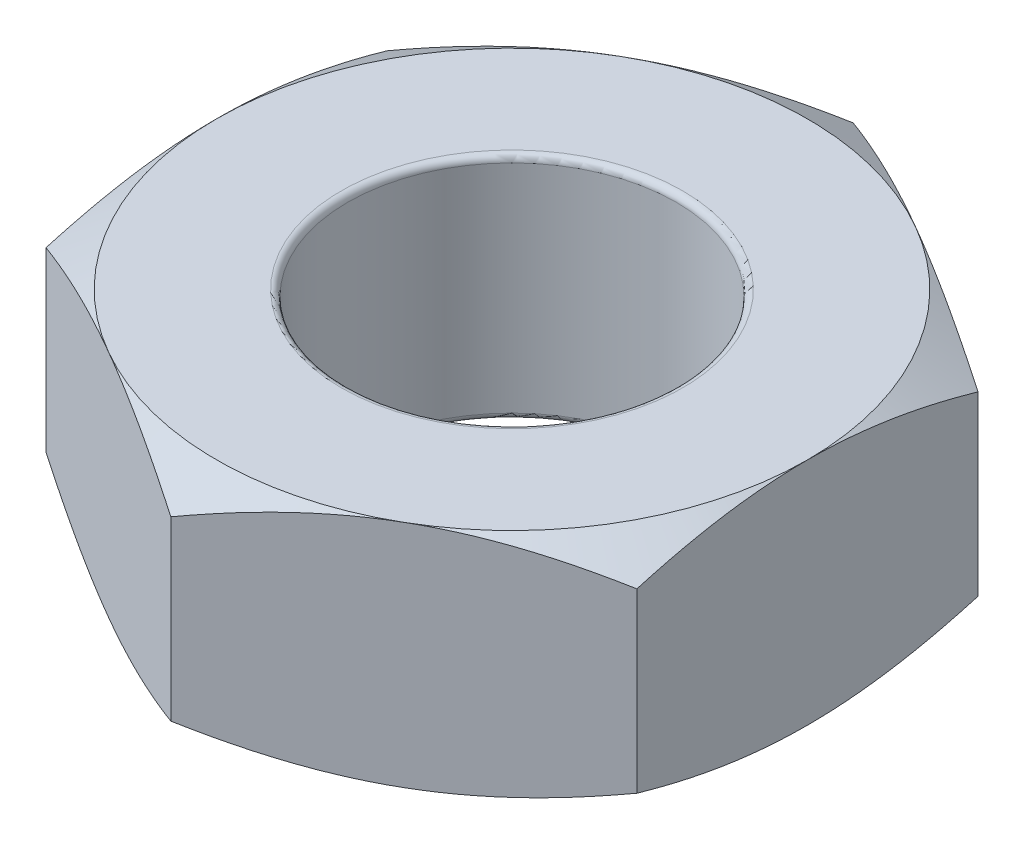
ISO-10303-21;
HEADER;
FILE_DESCRIPTION(('STEP AP214'),'2;1');
FILE_NAME('part.step','',(''),(''),'','','');
FILE_SCHEMA(('AUTOMOTIVE_DESIGN { 1 0 10303 214 1 1 1 1 }'));
ENDSEC;
DATA;
#1=APPLICATION_CONTEXT('core data for automotive mechanical design processes');
#2=APPLICATION_PROTOCOL_DEFINITION('international standard','automotive_design',2000,#1);
#3=PRODUCT_CONTEXT('',#1,'mechanical');
#4=PRODUCT('Part','Part','',(#3));
#5=PRODUCT_RELATED_PRODUCT_CATEGORY('part','',(#4));
#6=PRODUCT_DEFINITION_FORMATION('','',#4);
#7=PRODUCT_DEFINITION_CONTEXT('part definition',#1,'design');
#8=PRODUCT_DEFINITION('design','',#6,#7);
#9=PRODUCT_DEFINITION_SHAPE('','',#8);
#10=(LENGTH_UNIT() NAMED_UNIT(*) SI_UNIT(.MILLI.,.METRE.));
#11=(NAMED_UNIT(*) PLANE_ANGLE_UNIT() SI_UNIT($,.RADIAN.));
#12=(NAMED_UNIT(*) SI_UNIT($,.STERADIAN.) SOLID_ANGLE_UNIT());
#13=UNCERTAINTY_MEASURE_WITH_UNIT(LENGTH_MEASURE(1.E-05),#10,'distance_accuracy_value','');
#14=(GEOMETRIC_REPRESENTATION_CONTEXT(3) GLOBAL_UNCERTAINTY_ASSIGNED_CONTEXT((#13)) GLOBAL_UNIT_ASSIGNED_CONTEXT((#10,
#11,#12)) REPRESENTATION_CONTEXT('',''));
#15=CARTESIAN_POINT('',(0.,0.,0.));
#16=DIRECTION('',(0.,0.,1.));
#17=DIRECTION('',(1.,0.,0.));
#18=AXIS2_PLACEMENT_3D('',#15,#16,#17);
#19=CARTESIAN_POINT('',(0.,1.75,2.59807621135332));
#20=DIRECTION('',(-0.5,0.,-0.866025403784439));
#21=DIRECTION('',(-0.866025403784439,0.,0.5));
#22=AXIS2_PLACEMENT_3D('',#19,#20,#21);
#23=PLANE('',#22);
#24=CARTESIAN_POINT('',(2.2502,0.201028565434255,1.29892263562282));
#25=CARTESIAN_POINT('',(2.15132275118564,0.168055578047864,1.35600944184252));
#26=CARTESIAN_POINT('',(2.05159200282091,0.138067535415598,1.41358901625738));
#27=CARTESIAN_POINT('',(1.85040345977937,0.0857223882308783,1.52974527574029));
#28=CARTESIAN_POINT('',(1.74894208949705,0.0633838027064789,1.58832402518513));
#29=CARTESIAN_POINT('',(1.54727681019892,0.0286095576734192,1.7047555284741));
#30=CARTESIAN_POINT('',(1.44710393502333,0.0159424738337187,1.76259036492223));
#31=CARTESIAN_POINT('',(1.24628668739732,0.00081890741741938,1.87853225689703));
#32=CARTESIAN_POINT('',(1.1456430451668,-0.00165009697600096,1.93663889083104));
#33=CARTESIAN_POINT('',(0.957574835473434,0.00347837463602978,2.04522012232352));
#34=CARTESIAN_POINT('',(0.870122156108741,0.00981663451512071,2.09571095029608));
#35=CARTESIAN_POINT('',(0.695786567891225,0.0299076571898894,2.19636364908279));
#36=CARTESIAN_POINT('',(0.608904262311711,0.0436672872310841,2.24652517159694));
#37=CARTESIAN_POINT('',(0.434209045898264,0.0780662653506658,2.34738550181938));
#38=CARTESIAN_POINT('',(0.346418252564746,0.0988514715826557,2.39807153998286));
#39=CARTESIAN_POINT('',(0.172146263122405,0.146026087362979,2.49868751999961));
#40=CARTESIAN_POINT('',(0.0856628332489973,0.172404408014302,2.54861875151746));
#41=CARTESIAN_POINT('',(-0.000200000000000489,0.201028565434255,2.59819168140715));
#42=B_SPLINE_CURVE_WITH_KNOTS('',3,(#24,#25,#26,#27,#28,#29,#30,#31,#32,#33,#34,#35,#36,#37,#38,
#39,#40,#41),.UNSPECIFIED.,.F.,.F.,(4,2,2,2,2,2,2,2,4),(0.,0.356658826016552,0.714175103224236,
1.06284241804968,1.41108149062516,1.71433394539794,2.01786749258222,2.32813511279245,
2.63779325460359),.UNSPECIFIED.);
#43=CARTESIAN_POINT('',(2.25,0.200961894323341,1.29903810567666));
#44=VERTEX_POINT('',#43);
#45=CARTESIAN_POINT('',(1.125,0.,1.94855715851499));
#46=VERTEX_POINT('',#45);
#47=EDGE_CURVE('E126',#44,#46,#42,.T.);
#48=ORIENTED_EDGE('',*,*,#47,.F.);
#49=DIRECTION('',(0.,-1.,0.));
#50=VECTOR('',#49,1.);
#51=CARTESIAN_POINT('',(2.25,1.75,1.29903810567666));
#52=LINE('',#51,#50);
#53=CARTESIAN_POINT('',(2.25,1.54903810567666,1.29903810567666));
#54=VERTEX_POINT('',#53);
#55=EDGE_CURVE('E232',#54,#44,#52,.T.);
#56=ORIENTED_EDGE('',*,*,#55,.F.);
#57=CARTESIAN_POINT('',(-0.000200000000000392,1.54897143456575,2.59819168140715));
#58=CARTESIAN_POINT('',(0.0986772488143567,1.58194442195214,2.54110487518746));
#59=CARTESIAN_POINT('',(0.198407997179093,1.6119324645844,2.48352530077259));
#60=CARTESIAN_POINT('',(0.399596540220632,1.66427761176912,2.36736904128969));
#61=CARTESIAN_POINT('',(0.501057910502945,1.68661619729352,2.30879029184485));
#62=CARTESIAN_POINT('',(0.702723189801079,1.72139044232658,2.19235878855587));
#63=CARTESIAN_POINT('',(0.802896064976672,1.73405752616628,2.13452395210774));
#64=CARTESIAN_POINT('',(1.00371331260268,1.74918109258258,2.01858206013295));
#65=CARTESIAN_POINT('',(1.1043569548332,1.751650096976,1.96047542619893));
#66=CARTESIAN_POINT('',(1.29242516452657,1.74652162536397,1.85189419470646));
#67=CARTESIAN_POINT('',(1.37987784389126,1.74018336548488,1.8014033667339));
#68=CARTESIAN_POINT('',(1.55421343210877,1.72009234281011,1.70075066794718));
#69=CARTESIAN_POINT('',(1.64109573768829,1.70633271276892,1.65058914543304));
#70=CARTESIAN_POINT('',(1.81579095410174,1.67193373464933,1.54972881521059));
#71=CARTESIAN_POINT('',(1.90358174743525,1.65114852841734,1.49904277704712));
#72=CARTESIAN_POINT('',(2.0778537368776,1.60397391263702,1.39842679703037));
#73=CARTESIAN_POINT('',(2.164337166751,1.5775955919857,1.34849556551251));
#74=CARTESIAN_POINT('',(2.2502,1.54897143456575,1.29892263562282));
#75=B_SPLINE_CURVE_WITH_KNOTS('',3,(#57,#58,#59,#60,#61,#62,#63,#64,#65,#66,#67,#68,#69,#70,#71,
#72,#73,#74),.UNSPECIFIED.,.F.,.F.,(4,2,2,2,2,2,2,2,4),(0.,0.356658826016552,0.714175103224236,
1.06284241804968,1.41108149062516,1.71433394539794,2.01786749258222,2.32813511279245,
2.63779325460359),.UNSPECIFIED.);
#76=CARTESIAN_POINT('',(1.125,1.75,1.94855715851499));
#77=VERTEX_POINT('',#76);
#78=EDGE_CURVE('E373',#77,#54,#75,.T.);
#79=ORIENTED_EDGE('',*,*,#78,.F.);
#80=CARTESIAN_POINT('',(0.,1.54903810567666,2.59807621135332));
#81=VERTEX_POINT('',#80);
#82=EDGE_CURVE('E362',#81,#77,#75,.T.);
#83=ORIENTED_EDGE('',*,*,#82,.F.);
#84=DIRECTION('',(0.,-1.,0.));
#85=VECTOR('',#84,1.);
#86=CARTESIAN_POINT('',(0.,1.75,2.59807621135332));
#87=LINE('',#86,#85);
#88=CARTESIAN_POINT('',(0.,0.200961894323341,2.59807621135332));
#89=VERTEX_POINT('',#88);
#90=EDGE_CURVE('E161',#81,#89,#87,.T.);
#91=ORIENTED_EDGE('',*,*,#90,.T.);
#92=EDGE_CURVE('E139',#46,#89,#42,.T.);
#93=ORIENTED_EDGE('',*,*,#92,.F.);
#94=EDGE_LOOP('',(#48,#56,#79,#83,#91,#93));
#95=FACE_BOUND('',#94,.T.);
#96=ADVANCED_FACE('F37',(#95),#23,.F.);
#97=CARTESIAN_POINT('',(2.25,1.75,1.29903810567666));
#98=DIRECTION('',(-1.,0.,0.));
#99=DIRECTION('',(0.,0.,1.));
#100=AXIS2_PLACEMENT_3D('',#97,#98,#99);
#101=PLANE('',#100);
#102=CARTESIAN_POINT('',(2.25,1.57049861982334,-4.43172912721208));
#103=CARTESIAN_POINT('',(2.25,1.51735693759209,-4.32848794492226));
#104=CARTESIAN_POINT('',(2.25,1.46450484743296,-4.22509639331572));
#105=CARTESIAN_POINT('',(2.25,1.35952530789621,-4.01794384416323));
#106=CARTESIAN_POINT('',(2.25,1.30739787204856,-3.91418283976455));
#107=CARTESIAN_POINT('',(2.25,1.20393081844307,-3.70605700815303));
#108=CARTESIAN_POINT('',(2.25,1.1525926236047,-3.60169147231438));
#109=CARTESIAN_POINT('',(2.25,1.05099117669964,-3.39243582155597));
#110=CARTESIAN_POINT('',(2.25,1.000727939927,-3.28754569919877));
#111=CARTESIAN_POINT('',(2.25,0.898925995293035,-3.07160047020286));
#112=CARTESIAN_POINT('',(2.25,0.847459290612846,-2.96051132352861));
#113=CARTESIAN_POINT('',(2.25,0.746406212005017,-2.73748183196732));
#114=CARTESIAN_POINT('',(2.25,0.696819787356086,-2.62554151013899));
#115=CARTESIAN_POINT('',(2.25,0.600100967453589,-2.40069008962636));
#116=CARTESIAN_POINT('',(2.25,0.552966929054417,-2.28777970157739));
#117=CARTESIAN_POINT('',(2.25,0.46184651106863,-2.06065851247683));
#118=CARTESIAN_POINT('',(2.25,0.417860865336628,-1.94644741538902));
#119=CARTESIAN_POINT('',(2.25,0.32729368556671,-1.69797138865069));
#120=CARTESIAN_POINT('',(2.25,0.281435016134631,-1.56343919862733));
#121=CARTESIAN_POINT('',(2.25,0.1974750705298,-1.29200018214826));
#122=CARTESIAN_POINT('',(2.25,0.159369866726331,-1.15509459630545));
#123=CARTESIAN_POINT('',(2.25,0.0942889667848681,-0.881369269399072));
#124=CARTESIAN_POINT('',(2.25,0.0671140468085102,-0.744598126937423));
#125=CARTESIAN_POINT('',(2.25,0.0257222330991212,-0.469086445681223));
#126=CARTESIAN_POINT('',(2.25,0.0114977452462131,-0.330347109575203));
#127=CARTESIAN_POINT('',(2.25,0.00123269639131386,-0.120784370517545));
#128=CARTESIAN_POINT('',(2.25,-0.000315601094854518,-0.050203974634935));
#129=CARTESIAN_POINT('',(2.25,0.000422033997697021,0.0909367469657694));
#130=CARTESIAN_POINT('',(2.25,0.00270796730213804,0.161497072680062));
#131=CARTESIAN_POINT('',(2.25,0.0152377813490386,0.372864383623227));
#132=CARTESIAN_POINT('',(2.25,0.0311535146577739,0.51336108414487));
#133=CARTESIAN_POINT('',(2.25,0.0764279690031743,0.794982413158729));
#134=CARTESIAN_POINT('',(2.25,0.106052731323689,0.93606200731604));
#135=CARTESIAN_POINT('',(2.25,0.175669429631058,1.21561548141805));
#136=CARTESIAN_POINT('',(2.25,0.215664560549491,1.35408854420889));
#137=CARTESIAN_POINT('',(2.25,0.301433813240795,1.62298376559588));
#138=CARTESIAN_POINT('',(2.25,0.346906272940259,1.75350414338493));
#139=CARTESIAN_POINT('',(2.25,0.442941824020627,2.01267340913791));
#140=CARTESIAN_POINT('',(2.25,0.493506146306572,2.14132183593333));
#141=CARTESIAN_POINT('',(2.25,0.598415917250672,2.3972089614727));
#142=CARTESIAN_POINT('',(2.25,0.652765191067168,2.5244460788882));
#143=CARTESIAN_POINT('',(2.25,0.7642440388293,2.77769813848635));
#144=CARTESIAN_POINT('',(2.25,0.821373763792894,2.9037130138371));
#145=CARTESIAN_POINT('',(2.25,0.934436062749626,3.1476496239965));
#146=CARTESIAN_POINT('',(2.25,0.990252927298657,3.26562520727676));
#147=CARTESIAN_POINT('',(2.25,1.10334942732948,3.50087634814471));
#148=CARTESIAN_POINT('',(2.25,1.16062911044141,3.61815188278466));
#149=CARTESIAN_POINT('',(2.25,1.27615326827056,3.85174791850405));
#150=CARTESIAN_POINT('',(2.25,1.3343939714757,3.96807028911019));
#151=CARTESIAN_POINT('',(2.25,1.45180296105985,4.20023381118101));
#152=CARTESIAN_POINT('',(2.25,1.51097116762094,4.31607500298083));
#153=CARTESIAN_POINT('',(2.25,1.57049861982334,4.43172912721208));
#154=B_SPLINE_CURVE_WITH_KNOTS('',3,(#102,#103,#104,#105,#106,#107,#108,#109,#110,#111,#112,
#113,#114,#115,#116,#117,#118,#119,#120,#121,#122,#123,#124,#125,#126,#127,#128,#129,#130,#131,
#132,#133,#134,#135,#136,#137,#138,#139,#140,#141,#142,#143,#144,#145,#146,#147,#148,#149,#150,
#151,#152,#153),.UNSPECIFIED.,.F.,.F.,(4,2,2,2,2,2,2,2,2,2,2,2,2,2,2,2,2,2,2,2,2,2,2,2,2,4),(0.,
0.348347395383933,0.696701286027884,1.04562309484171,1.39454986466947,1.76183249981756,
2.12910522031386,2.49612860556298,2.86323726307789,3.2894710608127,3.71548840311864,
4.13334452619794,4.55095546076511,4.7626532574073,4.97435109411843,5.39773666667533,
5.82970728415092,6.26181114277157,6.67631854142574,7.09092638459783,7.50595949709434,
7.92101517699111,8.31254332110153,8.70408422986847,9.09434358465052,9.48456953737431),.UNSPECIFIED.);
#155=CARTESIAN_POINT('',(2.25,0.200961894323341,-1.29903810567666));
#156=VERTEX_POINT('',#155);
#157=CARTESIAN_POINT('',(2.25,0.,0.));
#158=VERTEX_POINT('',#157);
#159=EDGE_CURVE('E52',#156,#158,#154,.T.);
#160=ORIENTED_EDGE('',*,*,#159,.F.);
#161=DIRECTION('',(0.,-1.,0.));
#162=VECTOR('',#161,1.);
#163=CARTESIAN_POINT('',(2.25,1.75,-1.29903810567666));
#164=LINE('',#163,#162);
#165=CARTESIAN_POINT('',(2.25,1.54903810567666,-1.29903810567666));
#166=VERTEX_POINT('',#165);
#167=EDGE_CURVE('E365',#166,#156,#164,.T.);
#168=ORIENTED_EDGE('',*,*,#167,.F.);
#169=CARTESIAN_POINT('',(2.25,0.179501380176658,4.43172912721208));
#170=CARTESIAN_POINT('',(2.25,0.232643062407914,4.32848794492226));
#171=CARTESIAN_POINT('',(2.25,0.285495152567037,4.22509639331572));
#172=CARTESIAN_POINT('',(2.25,0.390474692103786,4.01794384416323));
#173=CARTESIAN_POINT('',(2.25,0.442602127951438,3.91418283976455));
#174=CARTESIAN_POINT('',(2.25,0.546069181556927,3.70605700815303));
#175=CARTESIAN_POINT('',(2.25,0.597407376395302,3.60169147231438));
#176=CARTESIAN_POINT('',(2.25,0.699008823300362,3.39243582155597));
#177=CARTESIAN_POINT('',(2.25,0.749272060072998,3.28754569919877));
#178=CARTESIAN_POINT('',(2.25,0.851074004706964,3.07160047020286));
#179=CARTESIAN_POINT('',(2.25,0.902540709387154,2.96051132352861));
#180=CARTESIAN_POINT('',(2.25,1.00359378799498,2.73748183196732));
#181=CARTESIAN_POINT('',(2.25,1.05318021264391,2.62554151013899));
#182=CARTESIAN_POINT('',(2.25,1.14989903254641,2.40069008962637));
#183=CARTESIAN_POINT('',(2.25,1.19703307094558,2.2877797015774));
#184=CARTESIAN_POINT('',(2.25,1.28815348893137,2.06065851247683));
#185=CARTESIAN_POINT('',(2.25,1.33213913466337,1.94644741538902));
#186=CARTESIAN_POINT('',(2.25,1.42270631443329,1.69797138865069));
#187=CARTESIAN_POINT('',(2.25,1.46856498386537,1.56343919862733));
#188=CARTESIAN_POINT('',(2.25,1.5525249294702,1.29200018214826));
#189=CARTESIAN_POINT('',(2.25,1.59063013327367,1.15509459630545));
#190=CARTESIAN_POINT('',(2.25,1.65571103321513,0.881369269399071));
#191=CARTESIAN_POINT('',(2.25,1.68288595319149,0.744598126937422));
#192=CARTESIAN_POINT('',(2.25,1.72427776690088,0.469086445681222));
#193=CARTESIAN_POINT('',(2.25,1.73850225475379,0.330347109575201));
#194=CARTESIAN_POINT('',(2.25,1.74876730360869,0.120784370517544));
#195=CARTESIAN_POINT('',(2.25,1.75031560109485,0.050203974634933));
#196=CARTESIAN_POINT('',(2.25,1.7495779660023,-0.0909367469657716));
#197=CARTESIAN_POINT('',(2.25,1.74729203269786,-0.161497072680064));
#198=CARTESIAN_POINT('',(2.25,1.73476221865096,-0.372864383623229));
#199=CARTESIAN_POINT('',(2.25,1.71884648534223,-0.513361084144872));
#200=CARTESIAN_POINT('',(2.25,1.67357203099683,-0.794982413158731));
#201=CARTESIAN_POINT('',(2.25,1.64394726867631,-0.936062007316043));
#202=CARTESIAN_POINT('',(2.25,1.57433057036894,-1.21561548141805));
#203=CARTESIAN_POINT('',(2.25,1.53433543945051,-1.35408854420889));
#204=CARTESIAN_POINT('',(2.25,1.4485661867592,-1.62298376559588));
#205=CARTESIAN_POINT('',(2.25,1.40309372705974,-1.75350414338493));
#206=CARTESIAN_POINT('',(2.25,1.30705817597937,-2.01267340913791));
#207=CARTESIAN_POINT('',(2.25,1.25649385369343,-2.14132183593333));
#208=CARTESIAN_POINT('',(2.25,1.15158408274933,-2.39720896147271));
#209=CARTESIAN_POINT('',(2.25,1.09723480893283,-2.5244460788882));
#210=CARTESIAN_POINT('',(2.25,0.9857559611707,-2.77769813848635));
#211=CARTESIAN_POINT('',(2.25,0.928626236207105,-2.9037130138371));
#212=CARTESIAN_POINT('',(2.25,0.815563937250373,-3.1476496239965));
#213=CARTESIAN_POINT('',(2.25,0.759747072701342,-3.26562520727677));
#214=CARTESIAN_POINT('',(2.25,0.646650572670521,-3.50087634814471));
#215=CARTESIAN_POINT('',(2.25,0.589370889558592,-3.61815188278466));
#216=CARTESIAN_POINT('',(2.25,0.47384673172944,-3.85174791850405));
#217=CARTESIAN_POINT('',(2.25,0.415606028524298,-3.96807028911019));
#218=CARTESIAN_POINT('',(2.25,0.29819703894015,-4.20023381118101));
#219=CARTESIAN_POINT('',(2.25,0.239028832379061,-4.31607500298083));
#220=CARTESIAN_POINT('',(2.25,0.179501380176658,-4.43172912721208));
#221=B_SPLINE_CURVE_WITH_KNOTS('',3,(#169,#170,#171,#172,#173,#174,#175,#176,#177,#178,#179,
#180,#181,#182,#183,#184,#185,#186,#187,#188,#189,#190,#191,#192,#193,#194,#195,#196,#197,#198,
#199,#200,#201,#202,#203,#204,#205,#206,#207,#208,#209,#210,#211,#212,#213,#214,#215,#216,#217,
#218,#219,#220),.UNSPECIFIED.,.F.,.F.,(4,2,2,2,2,2,2,2,2,2,2,2,2,2,2,2,2,2,2,2,2,2,2,2,2,4),(0.,
0.348347395383933,0.696701286027884,1.04562309484171,1.39454986466947,1.76183249981756,
2.12910522031385,2.49612860556298,2.86323726307789,3.2894710608127,3.71548840311864,
4.13334452619794,4.55095546076511,4.7626532574073,4.97435109411843,5.39773666667533,
5.82970728415093,6.26181114277157,6.67631854142574,7.09092638459783,7.50595949709434,
7.92101517699111,8.31254332110153,8.70408422986847,9.09434358465052,9.48456953737431),.UNSPECIFIED.);
#222=CARTESIAN_POINT('',(2.25,1.75,0.));
#223=VERTEX_POINT('',#222);
#224=EDGE_CURVE('E272',#223,#166,#221,.T.);
#225=ORIENTED_EDGE('',*,*,#224,.F.);
#226=EDGE_CURVE('E372',#54,#223,#221,.T.);
#227=ORIENTED_EDGE('',*,*,#226,.F.);
#228=ORIENTED_EDGE('',*,*,#55,.T.);
#229=EDGE_CURVE('E133',#158,#44,#154,.T.);
#230=ORIENTED_EDGE('',*,*,#229,.F.);
#231=EDGE_LOOP('',(#160,#168,#225,#227,#228,#230));
#232=FACE_BOUND('',#231,.T.);
#233=ADVANCED_FACE('F257',(#232),#101,.F.);
#234=CARTESIAN_POINT('',(2.25,1.75,-1.29903810567666));
#235=DIRECTION('',(-0.5,0.,0.866025403784439));
#236=DIRECTION('',(0.866025403784439,0.,0.5));
#237=AXIS2_PLACEMENT_3D('',#234,#235,#236);
#238=PLANE('',#237);
#239=CARTESIAN_POINT('',(-0.000199999999999888,0.201028565434255,-2.59819168140715));
#240=CARTESIAN_POINT('',(0.0986772488143577,0.168055578047864,-2.54110487518746));
#241=CARTESIAN_POINT('',(0.198407997179094,0.138067535415599,-2.48352530077259));
#242=CARTESIAN_POINT('',(0.399596540220633,0.0857223882308784,-2.36736904128969));
#243=CARTESIAN_POINT('',(0.501057910502946,0.0633838027064789,-2.30879029184485));
#244=CARTESIAN_POINT('',(0.702723189801079,0.0286095576734192,-2.19235878855587));
#245=CARTESIAN_POINT('',(0.802896064976673,0.0159424738337188,-2.13452395210774));
#246=CARTESIAN_POINT('',(1.00371331260268,0.000818907417419419,-2.01858206013295));
#247=CARTESIAN_POINT('',(1.1043569548332,-0.00165009697600108,-1.96047542619893));
#248=CARTESIAN_POINT('',(1.29242516452657,0.00347837463602965,-1.85189419470646));
#249=CARTESIAN_POINT('',(1.37987784389126,0.00981663451512069,-1.8014033667339));
#250=CARTESIAN_POINT('',(1.55421343210877,0.0299076571898894,-1.70075066794718));
#251=CARTESIAN_POINT('',(1.64109573768829,0.043667287231084,-1.65058914543304));
#252=CARTESIAN_POINT('',(1.81579095410174,0.0780662653506658,-1.54972881521059));
#253=CARTESIAN_POINT('',(1.90358174743525,0.0988514715826557,-1.49904277704712));
#254=CARTESIAN_POINT('',(2.07785373687759,0.146026087362979,-1.39842679703037));
#255=CARTESIAN_POINT('',(2.164337166751,0.172404408014302,-1.34849556551251));
#256=CARTESIAN_POINT('',(2.2502,0.201028565434254,-1.29892263562282));
#257=B_SPLINE_CURVE_WITH_KNOTS('',3,(#239,#240,#241,#242,#243,#244,#245,#246,#247,#248,#249,
#250,#251,#252,#253,#254,#255,#256),.UNSPECIFIED.,.F.,.F.,(4,2,2,2,2,2,2,2,4),(0.,
0.356658826016552,0.714175103224236,1.06284241804968,1.41108149062516,1.71433394539794,
2.01786749258222,2.32813511279245,2.63779325460359),.UNSPECIFIED.);
#258=CARTESIAN_POINT('',(0.,0.200961894323341,-2.59807621135332));
#259=VERTEX_POINT('',#258);
#260=CARTESIAN_POINT('',(1.125,0.,-1.94855715851499));
#261=VERTEX_POINT('',#260);
#262=EDGE_CURVE('E60',#259,#261,#257,.T.);
#263=ORIENTED_EDGE('',*,*,#262,.F.);
#264=DIRECTION('',(0.,-1.,0.));
#265=VECTOR('',#264,1.);
#266=CARTESIAN_POINT('',(0.,1.75,-2.59807621135332));
#267=LINE('',#266,#265);
#268=CARTESIAN_POINT('',(0.,1.54903810567666,-2.59807621135332));
#269=VERTEX_POINT('',#268);
#270=EDGE_CURVE('E360',#269,#259,#267,.T.);
#271=ORIENTED_EDGE('',*,*,#270,.F.);
#272=CARTESIAN_POINT('',(2.2502,1.54897143456575,-1.29892263562282));
#273=CARTESIAN_POINT('',(2.15132275118564,1.58194442195214,-1.35600944184252));
#274=CARTESIAN_POINT('',(2.05159200282091,1.6119324645844,-1.41358901625738));
#275=CARTESIAN_POINT('',(1.85040345977937,1.66427761176912,-1.52974527574028));
#276=CARTESIAN_POINT('',(1.74894208949705,1.68661619729352,-1.58832402518513));
#277=CARTESIAN_POINT('',(1.54727681019892,1.72139044232658,-1.7047555284741));
#278=CARTESIAN_POINT('',(1.44710393502333,1.73405752616628,-1.76259036492223));
#279=CARTESIAN_POINT('',(1.24628668739732,1.74918109258258,-1.87853225689703));
#280=CARTESIAN_POINT('',(1.1456430451668,1.751650096976,-1.93663889083104));
#281=CARTESIAN_POINT('',(0.957574835473434,1.74652162536397,-2.04522012232352));
#282=CARTESIAN_POINT('',(0.870122156108741,1.74018336548488,-2.09571095029608));
#283=CARTESIAN_POINT('',(0.695786567891226,1.72009234281011,-2.19636364908279));
#284=CARTESIAN_POINT('',(0.608904262311712,1.70633271276892,-2.24652517159694));
#285=CARTESIAN_POINT('',(0.434209045898264,1.67193373464933,-2.34738550181938));
#286=CARTESIAN_POINT('',(0.346418252564747,1.65114852841734,-2.39807153998286));
#287=CARTESIAN_POINT('',(0.172146263122405,1.60397391263702,-2.49868751999961));
#288=CARTESIAN_POINT('',(0.0856628332489977,1.5775955919857,-2.54861875151746));
#289=CARTESIAN_POINT('',(-0.000199999999999991,1.54897143456575,-2.59819168140715));
#290=B_SPLINE_CURVE_WITH_KNOTS('',3,(#272,#273,#274,#275,#276,#277,#278,#279,#280,#281,#282,
#283,#284,#285,#286,#287,#288,#289),.UNSPECIFIED.,.F.,.F.,(4,2,2,2,2,2,2,2,4),(0.,
0.356658826016552,0.714175103224236,1.06284241804968,1.41108149062516,1.71433394539794,
2.01786749258222,2.32813511279245,2.63779325460359),.UNSPECIFIED.);
#291=CARTESIAN_POINT('',(1.125,1.75,-1.94855715851499));
#292=VERTEX_POINT('',#291);
#293=EDGE_CURVE('E321',#292,#269,#290,.T.);
#294=ORIENTED_EDGE('',*,*,#293,.F.);
#295=EDGE_CURVE('E379',#166,#292,#290,.T.);
#296=ORIENTED_EDGE('',*,*,#295,.F.);
#297=ORIENTED_EDGE('',*,*,#167,.T.);
#298=EDGE_CURVE('E199',#261,#156,#257,.T.);
#299=ORIENTED_EDGE('',*,*,#298,.F.);
#300=EDGE_LOOP('',(#263,#271,#294,#296,#297,#299));
#301=FACE_BOUND('',#300,.T.);
#302=ADVANCED_FACE('F261',(#301),#238,.F.);
#303=CARTESIAN_POINT('',(0.,1.75,-2.59807621135332));
#304=DIRECTION('',(0.5,0.,0.866025403784439));
#305=DIRECTION('',(0.866025403784439,0.,-0.5));
#306=AXIS2_PLACEMENT_3D('',#303,#304,#305);
#307=PLANE('',#306);
#308=CARTESIAN_POINT('',(-2.2502,0.201028565434255,-1.29892263562282));
#309=CARTESIAN_POINT('',(-2.15132275118564,0.168055578047864,-1.35600944184252));
#310=CARTESIAN_POINT('',(-2.05159200282091,0.138067535415599,-1.41358901625738));
#311=CARTESIAN_POINT('',(-1.85040345977937,0.0857223882308785,-1.52974527574028));
#312=CARTESIAN_POINT('',(-1.74894208949706,0.0633838027064792,-1.58832402518513));
#313=CARTESIAN_POINT('',(-1.54727681019892,0.0286095576734194,-1.7047555284741));
#314=CARTESIAN_POINT('',(-1.44710393502333,0.015942473833719,-1.76259036492223));
#315=CARTESIAN_POINT('',(-1.24628668739732,0.00081890741741939,-1.87853225689703));
#316=CARTESIAN_POINT('',(-1.1456430451668,-0.00165009697600117,-1.93663889083104));
#317=CARTESIAN_POINT('',(-0.957574835473435,0.00347837463602961,-2.04522012232352));
#318=CARTESIAN_POINT('',(-0.870122156108742,0.00981663451512076,-2.09571095029608));
#319=CARTESIAN_POINT('',(-0.695786567891226,0.0299076571898895,-2.19636364908279));
#320=CARTESIAN_POINT('',(-0.608904262311712,0.043667287231084,-2.24652517159694));
#321=CARTESIAN_POINT('',(-0.434209045898264,0.0780662653506659,-2.34738550181938));
#322=CARTESIAN_POINT('',(-0.346418252564747,0.098851471582656,-2.39807153998286));
#323=CARTESIAN_POINT('',(-0.172146263122405,0.14602608736298,-2.49868751999961));
#324=CARTESIAN_POINT('',(-0.0856628332489975,0.172404408014303,-2.54861875151746));
#325=CARTESIAN_POINT('',(0.000200000000000092,0.201028565434255,-2.59819168140715));
#326=B_SPLINE_CURVE_WITH_KNOTS('',3,(#308,#309,#310,#311,#312,#313,#314,#315,#316,#317,#318,
#319,#320,#321,#322,#323,#324,#325),.UNSPECIFIED.,.F.,.F.,(4,2,2,2,2,2,2,2,4),(0.,
0.356658826016552,0.714175103224237,1.06284241804968,1.41108149062516,1.71433394539794,
2.01786749258222,2.32813511279245,2.63779325460359),.UNSPECIFIED.);
#327=CARTESIAN_POINT('',(-2.25,0.200961894323336,-1.29903810567667));
#328=VERTEX_POINT('',#327);
#329=CARTESIAN_POINT('',(-1.125,0.,-1.94855715851499));
#330=VERTEX_POINT('',#329);
#331=EDGE_CURVE('E177',#328,#330,#326,.T.);
#332=ORIENTED_EDGE('',*,*,#331,.F.);
#333=DIRECTION('',(0.,-1.,0.));
#334=VECTOR('',#333,1.);
#335=CARTESIAN_POINT('',(-2.25,1.75,-1.29903810567666));
#336=LINE('',#335,#334);
#337=CARTESIAN_POINT('',(-2.25,1.54903810567666,-1.29903810567666));
#338=VERTEX_POINT('',#337);
#339=EDGE_CURVE('E328',#338,#328,#336,.T.);
#340=ORIENTED_EDGE('',*,*,#339,.F.);
#341=CARTESIAN_POINT('',(0.000200000000000067,1.54897143456574,-2.59819168140715));
#342=CARTESIAN_POINT('',(-0.0986772488143574,1.58194442195214,-2.54110487518746));
#343=CARTESIAN_POINT('',(-0.198407997179094,1.6119324645844,-2.48352530077259));
#344=CARTESIAN_POINT('',(-0.399596540220633,1.66427761176912,-2.36736904128969));
#345=CARTESIAN_POINT('',(-0.501057910502946,1.68661619729352,-2.30879029184485));
#346=CARTESIAN_POINT('',(-0.702723189801079,1.72139044232658,-2.19235878855587));
#347=CARTESIAN_POINT('',(-0.802896064976672,1.73405752616628,-2.13452395210774));
#348=CARTESIAN_POINT('',(-1.00371331260268,1.74918109258258,-2.01858206013295));
#349=CARTESIAN_POINT('',(-1.1043569548332,1.751650096976,-1.96047542619893));
#350=CARTESIAN_POINT('',(-1.29242516452657,1.74652162536397,-1.85189419470646));
#351=CARTESIAN_POINT('',(-1.37987784389126,1.74018336548488,-1.8014033667339));
#352=CARTESIAN_POINT('',(-1.55421343210877,1.72009234281011,-1.70075066794718));
#353=CARTESIAN_POINT('',(-1.64109573768829,1.70633271276892,-1.65058914543304));
#354=CARTESIAN_POINT('',(-1.81579095410174,1.67193373464933,-1.54972881521059));
#355=CARTESIAN_POINT('',(-1.90358174743525,1.65114852841734,-1.49904277704711));
#356=CARTESIAN_POINT('',(-2.0778537368776,1.60397391263702,-1.39842679703037));
#357=CARTESIAN_POINT('',(-2.164337166751,1.5775955919857,-1.34849556551251));
#358=CARTESIAN_POINT('',(-2.2502,1.54897143456574,-1.29892263562282));
#359=B_SPLINE_CURVE_WITH_KNOTS('',3,(#341,#342,#343,#344,#345,#346,#347,#348,#349,#350,#351,
#352,#353,#354,#355,#356,#357,#358),.UNSPECIFIED.,.F.,.F.,(4,2,2,2,2,2,2,2,4),(0.,
0.356658826016553,0.714175103224236,1.06284241804968,1.41108149062516,1.71433394539794,
2.01786749258222,2.32813511279245,2.63779325460359),.UNSPECIFIED.);
#360=CARTESIAN_POINT('',(-1.125,1.75,-1.94855715851499));
#361=VERTEX_POINT('',#360);
#362=EDGE_CURVE('E312',#361,#338,#359,.T.);
#363=ORIENTED_EDGE('',*,*,#362,.F.);
#364=EDGE_CURVE('E317',#269,#361,#359,.T.);
#365=ORIENTED_EDGE('',*,*,#364,.F.);
#366=ORIENTED_EDGE('',*,*,#270,.T.);
#367=EDGE_CURVE('E283',#330,#259,#326,.T.);
#368=ORIENTED_EDGE('',*,*,#367,.F.);
#369=EDGE_LOOP('',(#332,#340,#363,#365,#366,#368));
#370=FACE_BOUND('',#369,.T.);
#371=ADVANCED_FACE('F266',(#370),#307,.F.);
#372=CARTESIAN_POINT('',(-2.25,1.75,-1.29903810567666));
#373=DIRECTION('',(1.,0.,0.));
#374=DIRECTION('',(0.,0.,-1.));
#375=AXIS2_PLACEMENT_3D('',#372,#373,#374);
#376=PLANE('',#375);
#377=CARTESIAN_POINT('',(-2.25,1.57049861982334,4.43172912721208));
#378=CARTESIAN_POINT('',(-2.25,1.51735693759208,4.32848794492226));
#379=CARTESIAN_POINT('',(-2.25,1.46450484743296,4.22509639331572));
#380=CARTESIAN_POINT('',(-2.25,1.35952530789621,4.01794384416323));
#381=CARTESIAN_POINT('',(-2.25,1.30739787204856,3.91418283976455));
#382=CARTESIAN_POINT('',(-2.25,1.20393081844307,3.70605700815303));
#383=CARTESIAN_POINT('',(-2.25,1.1525926236047,3.60169147231438));
#384=CARTESIAN_POINT('',(-2.25,1.05099117669964,3.39243582155596));
#385=CARTESIAN_POINT('',(-2.25,1.000727939927,3.28754569919877));
#386=CARTESIAN_POINT('',(-2.25,0.898925995293034,3.07160047020285));
#387=CARTESIAN_POINT('',(-2.25,0.847459290612845,2.96051132352861));
#388=CARTESIAN_POINT('',(-2.25,0.746406212005017,2.73748183196732));
#389=CARTESIAN_POINT('',(-2.25,0.696819787356086,2.62554151013899));
#390=CARTESIAN_POINT('',(-2.25,0.600100967453589,2.40069008962636));
#391=CARTESIAN_POINT('',(-2.25,0.552966929054416,2.28777970157739));
#392=CARTESIAN_POINT('',(-2.25,0.46184651106863,2.06065851247683));
#393=CARTESIAN_POINT('',(-2.25,0.417860865336628,1.94644741538902));
#394=CARTESIAN_POINT('',(-2.25,0.32729368556671,1.69797138865069));
#395=CARTESIAN_POINT('',(-2.25,0.281435016134631,1.56343919862733));
#396=CARTESIAN_POINT('',(-2.25,0.1974750705298,1.29200018214826));
#397=CARTESIAN_POINT('',(-2.25,0.159369866726332,1.15509459630545));
#398=CARTESIAN_POINT('',(-2.25,0.0942889667848684,0.881369269399069));
#399=CARTESIAN_POINT('',(-2.25,0.0671140468085106,0.744598126937421));
#400=CARTESIAN_POINT('',(-2.25,0.0257222330991217,0.469086445681221));
#401=CARTESIAN_POINT('',(-2.25,0.0114977452462136,0.3303471095752));
#402=CARTESIAN_POINT('',(-2.25,0.00123269639131458,0.120784370517543));
#403=CARTESIAN_POINT('',(-2.25,-0.000315601094853687,0.0502039746349321));
#404=CARTESIAN_POINT('',(-2.25,0.000422033997697937,-0.0909367469657726));
#405=CARTESIAN_POINT('',(-2.25,0.00270796730213891,-0.161497072680065));
#406=CARTESIAN_POINT('',(-2.25,0.0152377813490394,-0.37286438362323));
#407=CARTESIAN_POINT('',(-2.25,0.0311535146577748,-0.513361084144873));
#408=CARTESIAN_POINT('',(-2.25,0.0764279690031754,-0.794982413158732));
#409=CARTESIAN_POINT('',(-2.25,0.10605273132369,-0.936062007316043));
#410=CARTESIAN_POINT('',(-2.25,0.175669429631059,-1.21561548141805));
#411=CARTESIAN_POINT('',(-2.25,0.215664560549492,-1.35408854420889));
#412=CARTESIAN_POINT('',(-2.25,0.301433813240796,-1.62298376559588));
#413=CARTESIAN_POINT('',(-2.25,0.34690627294026,-1.75350414338493));
#414=CARTESIAN_POINT('',(-2.25,0.442941824020628,-2.01267340913791));
#415=CARTESIAN_POINT('',(-2.25,0.493506146306573,-2.14132183593333));
#416=CARTESIAN_POINT('',(-2.25,0.598415917250672,-2.3972089614727));
#417=CARTESIAN_POINT('',(-2.25,0.652765191067169,-2.5244460788882));
#418=CARTESIAN_POINT('',(-2.25,0.7642440388293,-2.77769813848635));
#419=CARTESIAN_POINT('',(-2.25,0.821373763792894,-2.9037130138371));
#420=CARTESIAN_POINT('',(-2.25,0.934436062749626,-3.1476496239965));
#421=CARTESIAN_POINT('',(-2.25,0.990252927298657,-3.26562520727676));
#422=CARTESIAN_POINT('',(-2.25,1.10334942732948,-3.50087634814471));
#423=CARTESIAN_POINT('',(-2.25,1.16062911044141,-3.61815188278466));
#424=CARTESIAN_POINT('',(-2.25,1.27615326827056,-3.85174791850405));
#425=CARTESIAN_POINT('',(-2.25,1.3343939714757,-3.96807028911018));
#426=CARTESIAN_POINT('',(-2.25,1.45180296105985,-4.20023381118101));
#427=CARTESIAN_POINT('',(-2.25,1.51097116762094,-4.31607500298083));
#428=CARTESIAN_POINT('',(-2.25,1.57049861982334,-4.43172912721207));
#429=B_SPLINE_CURVE_WITH_KNOTS('',3,(#377,#378,#379,#380,#381,#382,#383,#384,#385,#386,#387,
#388,#389,#390,#391,#392,#393,#394,#395,#396,#397,#398,#399,#400,#401,#402,#403,#404,#405,#406,
#407,#408,#409,#410,#411,#412,#413,#414,#415,#416,#417,#418,#419,#420,#421,#422,#423,#424,#425,
#426,#427,#428),.UNSPECIFIED.,.F.,.F.,(4,2,2,2,2,2,2,2,2,2,2,2,2,2,2,2,2,2,2,2,2,2,2,2,2,4),(0.,
0.348347395383933,0.696701286027883,1.04562309484171,1.39454986466947,1.76183249981756,
2.12910522031385,2.49612860556298,2.86323726307789,3.2894710608127,3.71548840311863,
4.13334452619794,4.55095546076511,4.7626532574073,4.97435109411843,5.39773666667532,
5.82970728415092,6.26181114277156,6.67631854142574,7.09092638459783,7.50595949709433,
7.9210151769911,8.31254332110152,8.70408422986847,9.09434358465051,9.4845695373743),.UNSPECIFIED.);
#430=CARTESIAN_POINT('',(-2.25,0.200961894323342,1.29903810567666));
#431=VERTEX_POINT('',#430);
#432=CARTESIAN_POINT('',(-2.25,0.,0.));
#433=VERTEX_POINT('',#432);
#434=EDGE_CURVE('E162',#431,#433,#429,.T.);
#435=ORIENTED_EDGE('',*,*,#434,.F.);
#436=DIRECTION('',(0.,-1.,0.));
#437=VECTOR('',#436,1.);
#438=CARTESIAN_POINT('',(-2.25,1.75,1.29903810567666));
#439=LINE('',#438,#437);
#440=CARTESIAN_POINT('',(-2.25,1.54903810567666,1.29903810567666));
#441=VERTEX_POINT('',#440);
#442=EDGE_CURVE('E354',#441,#431,#439,.T.);
#443=ORIENTED_EDGE('',*,*,#442,.F.);
#444=CARTESIAN_POINT('',(-2.25,0.17950138017666,-4.43172912721208));
#445=CARTESIAN_POINT('',(-2.25,0.232643062407915,-4.32848794492226));
#446=CARTESIAN_POINT('',(-2.25,0.285495152567039,-4.22509639331572));
#447=CARTESIAN_POINT('',(-2.25,0.390474692103788,-4.01794384416323));
#448=CARTESIAN_POINT('',(-2.25,0.442602127951439,-3.91418283976455));
#449=CARTESIAN_POINT('',(-2.25,0.546069181556928,-3.70605700815303));
#450=CARTESIAN_POINT('',(-2.25,0.597407376395303,-3.60169147231438));
#451=CARTESIAN_POINT('',(-2.25,0.699008823300362,-3.39243582155596));
#452=CARTESIAN_POINT('',(-2.25,0.749272060072999,-3.28754569919877));
#453=CARTESIAN_POINT('',(-2.25,0.851074004706966,-3.07160047020285));
#454=CARTESIAN_POINT('',(-2.25,0.902540709387155,-2.96051132352861));
#455=CARTESIAN_POINT('',(-2.25,1.00359378799498,-2.73748183196732));
#456=CARTESIAN_POINT('',(-2.25,1.05318021264391,-2.62554151013899));
#457=CARTESIAN_POINT('',(-2.25,1.14989903254641,-2.40069008962636));
#458=CARTESIAN_POINT('',(-2.25,1.19703307094558,-2.28777970157739));
#459=CARTESIAN_POINT('',(-2.25,1.28815348893137,-2.06065851247683));
#460=CARTESIAN_POINT('',(-2.25,1.33213913466337,-1.94644741538902));
#461=CARTESIAN_POINT('',(-2.25,1.42270631443329,-1.69797138865069));
#462=CARTESIAN_POINT('',(-2.25,1.46856498386537,-1.56343919862733));
#463=CARTESIAN_POINT('',(-2.25,1.5525249294702,-1.29200018214826));
#464=CARTESIAN_POINT('',(-2.25,1.59063013327367,-1.15509459630545));
#465=CARTESIAN_POINT('',(-2.25,1.65571103321513,-0.881369269399069));
#466=CARTESIAN_POINT('',(-2.25,1.68288595319149,-0.744598126937421));
#467=CARTESIAN_POINT('',(-2.25,1.72427776690088,-0.469086445681221));
#468=CARTESIAN_POINT('',(-2.25,1.73850225475379,-0.330347109575201));
#469=CARTESIAN_POINT('',(-2.25,1.74876730360869,-0.120784370517543));
#470=CARTESIAN_POINT('',(-2.25,1.75031560109485,-0.0502039746349321));
#471=CARTESIAN_POINT('',(-2.25,1.7495779660023,0.0909367469657725));
#472=CARTESIAN_POINT('',(-2.25,1.74729203269786,0.161497072680065));
#473=CARTESIAN_POINT('',(-2.25,1.73476221865096,0.37286438362323));
#474=CARTESIAN_POINT('',(-2.25,1.71884648534223,0.513361084144873));
#475=CARTESIAN_POINT('',(-2.25,1.67357203099682,0.794982413158732));
#476=CARTESIAN_POINT('',(-2.25,1.64394726867631,0.936062007316043));
#477=CARTESIAN_POINT('',(-2.25,1.57433057036894,1.21561548141805));
#478=CARTESIAN_POINT('',(-2.25,1.53433543945051,1.35408854420889));
#479=CARTESIAN_POINT('',(-2.25,1.4485661867592,1.62298376559588));
#480=CARTESIAN_POINT('',(-2.25,1.40309372705974,1.75350414338493));
#481=CARTESIAN_POINT('',(-2.25,1.30705817597937,2.01267340913791));
#482=CARTESIAN_POINT('',(-2.25,1.25649385369343,2.14132183593333));
#483=CARTESIAN_POINT('',(-2.25,1.15158408274933,2.3972089614727));
#484=CARTESIAN_POINT('',(-2.25,1.09723480893283,2.5244460788882));
#485=CARTESIAN_POINT('',(-2.25,0.985755961170701,2.77769813848635));
#486=CARTESIAN_POINT('',(-2.25,0.928626236207106,2.9037130138371));
#487=CARTESIAN_POINT('',(-2.25,0.815563937250374,3.1476496239965));
#488=CARTESIAN_POINT('',(-2.25,0.759747072701343,3.26562520727676));
#489=CARTESIAN_POINT('',(-2.25,0.646650572670522,3.50087634814471));
#490=CARTESIAN_POINT('',(-2.25,0.589370889558592,3.61815188278466));
#491=CARTESIAN_POINT('',(-2.25,0.473846731729441,3.85174791850405));
#492=CARTESIAN_POINT('',(-2.25,0.4156060285243,3.96807028911018));
#493=CARTESIAN_POINT('',(-2.25,0.298197038940152,4.20023381118101));
#494=CARTESIAN_POINT('',(-2.25,0.239028832379063,4.31607500298083));
#495=CARTESIAN_POINT('',(-2.25,0.17950138017666,4.43172912721207));
#496=B_SPLINE_CURVE_WITH_KNOTS('',3,(#444,#445,#446,#447,#448,#449,#450,#451,#452,#453,#454,
#455,#456,#457,#458,#459,#460,#461,#462,#463,#464,#465,#466,#467,#468,#469,#470,#471,#472,#473,
#474,#475,#476,#477,#478,#479,#480,#481,#482,#483,#484,#485,#486,#487,#488,#489,#490,#491,#492,
#493,#494,#495),.UNSPECIFIED.,.F.,.F.,(4,2,2,2,2,2,2,2,2,2,2,2,2,2,2,2,2,2,2,2,2,2,2,2,2,4),(0.,
0.348347395383933,0.696701286027883,1.04562309484171,1.39454986466947,1.76183249981756,
2.12910522031385,2.49612860556298,2.86323726307789,3.2894710608127,3.71548840311863,
4.13334452619794,4.55095546076511,4.7626532574073,4.97435109411843,5.39773666667532,
5.82970728415092,6.26181114277156,6.67631854142574,7.09092638459783,7.50595949709433,
7.9210151769911,8.31254332110152,8.70408422986847,9.09434358465051,9.4845695373743),.UNSPECIFIED.);
#497=CARTESIAN_POINT('',(-2.25,1.75,0.));
#498=VERTEX_POINT('',#497);
#499=EDGE_CURVE('E299',#498,#441,#496,.T.);
#500=ORIENTED_EDGE('',*,*,#499,.F.);
#501=EDGE_CURVE('E303',#338,#498,#496,.T.);
#502=ORIENTED_EDGE('',*,*,#501,.F.);
#503=ORIENTED_EDGE('',*,*,#339,.T.);
#504=EDGE_CURVE('E138',#433,#328,#429,.T.);
#505=ORIENTED_EDGE('',*,*,#504,.F.);
#506=EDGE_LOOP('',(#435,#443,#500,#502,#503,#505));
#507=FACE_BOUND('',#506,.T.);
#508=ADVANCED_FACE('F220',(#507),#376,.F.);
#509=CARTESIAN_POINT('',(-2.25,1.75,1.29903810567666));
#510=DIRECTION('',(0.5,0.,-0.866025403784439));
#511=DIRECTION('',(-0.866025403784439,0.,-0.5));
#512=AXIS2_PLACEMENT_3D('',#509,#510,#511);
#513=PLANE('',#512);
#514=CARTESIAN_POINT('',(0.000199999999999646,0.201028565434255,2.59819168140715));
#515=CARTESIAN_POINT('',(-0.0986772488143575,0.168055578047864,2.54110487518746));
#516=CARTESIAN_POINT('',(-0.198407997179094,0.138067535415598,2.48352530077259));
#517=CARTESIAN_POINT('',(-0.399596540220633,0.0857223882308781,2.36736904128969));
#518=CARTESIAN_POINT('',(-0.501057910502946,0.0633838027064789,2.30879029184485));
#519=CARTESIAN_POINT('',(-0.702723189801079,0.0286095576734192,2.19235878855587));
#520=CARTESIAN_POINT('',(-0.802896064976673,0.0159424738337187,2.13452395210774));
#521=CARTESIAN_POINT('',(-1.00371331260268,0.000818907417419241,2.01858206013295));
#522=CARTESIAN_POINT('',(-1.1043569548332,-0.00165009697600124,1.96047542619893));
#523=CARTESIAN_POINT('',(-1.29242516452657,0.00347837463602956,1.85189419470646));
#524=CARTESIAN_POINT('',(-1.37987784389126,0.00981663451512066,1.8014033667339));
#525=CARTESIAN_POINT('',(-1.55421343210877,0.0299076571898894,1.70075066794718));
#526=CARTESIAN_POINT('',(-1.64109573768829,0.0436672872310839,1.65058914543304));
#527=CARTESIAN_POINT('',(-1.81579095410174,0.0780662653506658,1.54972881521059));
#528=CARTESIAN_POINT('',(-1.90358174743525,0.0988514715826559,1.49904277704711));
#529=CARTESIAN_POINT('',(-2.0778537368776,0.14602608736298,1.39842679703037));
#530=CARTESIAN_POINT('',(-2.164337166751,0.172404408014302,1.34849556551251));
#531=CARTESIAN_POINT('',(-2.2502,0.201028565434255,1.29892263562282));
#532=B_SPLINE_CURVE_WITH_KNOTS('',3,(#514,#515,#516,#517,#518,#519,#520,#521,#522,#523,#524,
#525,#526,#527,#528,#529,#530,#531),.UNSPECIFIED.,.F.,.F.,(4,2,2,2,2,2,2,2,4),(0.,
0.356658826016552,0.714175103224236,1.06284241804968,1.41108149062516,1.71433394539794,
2.01786749258222,2.32813511279245,2.63779325460359),.UNSPECIFIED.);
#533=CARTESIAN_POINT('',(-1.125,0.,1.94855715851499));
#534=VERTEX_POINT('',#533);
#535=EDGE_CURVE('E146',#89,#534,#532,.T.);
#536=ORIENTED_EDGE('',*,*,#535,.F.);
#537=ORIENTED_EDGE('',*,*,#90,.F.);
#538=CARTESIAN_POINT('',(-2.2502,1.54897143456574,1.29892263562282));
#539=CARTESIAN_POINT('',(-2.15132275118564,1.58194442195214,1.35600944184252));
#540=CARTESIAN_POINT('',(-2.05159200282091,1.6119324645844,1.41358901625738));
#541=CARTESIAN_POINT('',(-1.85040345977937,1.66427761176912,1.52974527574028));
#542=CARTESIAN_POINT('',(-1.74894208949706,1.68661619729352,1.58832402518513));
#543=CARTESIAN_POINT('',(-1.54727681019892,1.72139044232658,1.7047555284741));
#544=CARTESIAN_POINT('',(-1.44710393502333,1.73405752616628,1.76259036492223));
#545=CARTESIAN_POINT('',(-1.24628668739732,1.74918109258258,1.87853225689703));
#546=CARTESIAN_POINT('',(-1.1456430451668,1.751650096976,1.93663889083104));
#547=CARTESIAN_POINT('',(-0.957574835473435,1.74652162536397,2.04522012232352));
#548=CARTESIAN_POINT('',(-0.870122156108742,1.74018336548488,2.09571095029608));
#549=CARTESIAN_POINT('',(-0.695786567891226,1.72009234281011,2.19636364908279));
#550=CARTESIAN_POINT('',(-0.608904262311712,1.70633271276892,2.24652517159694));
#551=CARTESIAN_POINT('',(-0.434209045898265,1.67193373464933,2.34738550181938));
#552=CARTESIAN_POINT('',(-0.346418252564747,1.65114852841734,2.39807153998286));
#553=CARTESIAN_POINT('',(-0.172146263122405,1.60397391263702,2.49868751999961));
#554=CARTESIAN_POINT('',(-0.0856628332489978,1.5775955919857,2.54861875151746));
#555=CARTESIAN_POINT('',(0.000199999999999607,1.54897143456575,2.59819168140715));
#556=B_SPLINE_CURVE_WITH_KNOTS('',3,(#538,#539,#540,#541,#542,#543,#544,#545,#546,#547,#548,
#549,#550,#551,#552,#553,#554,#555),.UNSPECIFIED.,.F.,.F.,(4,2,2,2,2,2,2,2,4),(0.,
0.356658826016552,0.714175103224236,1.06284241804968,1.41108149062516,1.71433394539794,
2.01786749258222,2.32813511279245,2.63779325460359),.UNSPECIFIED.);
#557=CARTESIAN_POINT('',(-1.125,1.75,1.94855715851499));
#558=VERTEX_POINT('',#557);
#559=EDGE_CURVE('E226',#558,#81,#556,.T.);
#560=ORIENTED_EDGE('',*,*,#559,.F.);
#561=EDGE_CURVE('E151',#441,#558,#556,.T.);
#562=ORIENTED_EDGE('',*,*,#561,.F.);
#563=ORIENTED_EDGE('',*,*,#442,.T.);
#564=EDGE_CURVE('E208',#534,#431,#532,.T.);
#565=ORIENTED_EDGE('',*,*,#564,.F.);
#566=EDGE_LOOP('',(#536,#537,#560,#562,#563,#565));
#567=FACE_BOUND('',#566,.T.);
#568=ADVANCED_FACE('F216',(#567),#513,.F.);
#569=CARTESIAN_POINT('',(0.,0.,0.));
#570=DIRECTION('',(0.,1.,0.));
#571=DIRECTION('',(0.,0.,1.));
#572=AXIS2_PLACEMENT_3D('',#569,#570,#571);
#573=PLANE('',#572);
#574=CARTESIAN_POINT('',(0.,0.,0.));
#575=DIRECTION('',(0.,1.,0.));
#576=DIRECTION('',(0.,0.,1.));
#577=AXIS2_PLACEMENT_3D('',#574,#575,#576);
#578=CIRCLE('',#577,1.3);
#579=CARTESIAN_POINT('',(0.,0.,1.3));
#580=VERTEX_POINT('',#579);
#581=EDGE_CURVE('E156',#580,#580,#578,.T.);
#582=ORIENTED_EDGE('',*,*,#581,.T.);
#583=EDGE_LOOP('',(#582));
#584=FACE_BOUND('',#583,.T.);
#585=CARTESIAN_POINT('',(0.,0.,0.));
#586=DIRECTION('',(0.,1.,0.));
#587=DIRECTION('',(0.,0.,1.));
#588=AXIS2_PLACEMENT_3D('',#585,#586,#587);
#589=CIRCLE('',#588,2.25);
#590=EDGE_CURVE('E130',#46,#158,#589,.T.);
#591=ORIENTED_EDGE('',*,*,#590,.F.);
#592=EDGE_CURVE('E143',#534,#46,#589,.T.);
#593=ORIENTED_EDGE('',*,*,#592,.F.);
#594=EDGE_CURVE('E150',#433,#534,#589,.T.);
#595=ORIENTED_EDGE('',*,*,#594,.F.);
#596=EDGE_CURVE('E545',#330,#433,#589,.T.);
#597=ORIENTED_EDGE('',*,*,#596,.F.);
#598=EDGE_CURVE('E157',#261,#330,#589,.T.);
#599=ORIENTED_EDGE('',*,*,#598,.F.);
#600=CARTESIAN_POINT('',(0.,0.,0.));
#601=DIRECTION('',(0.,-1.,0.));
#602=DIRECTION('',(0.,0.,-1.));
#603=AXIS2_PLACEMENT_3D('',#600,#601,#602);
#604=CIRCLE('',#603,2.25);
#605=EDGE_CURVE('E155',#261,#158,#604,.T.);
#606=ORIENTED_EDGE('',*,*,#605,.T.);
#607=EDGE_LOOP('',(#591,#593,#595,#597,#599,#606));
#608=FACE_BOUND('',#607,.T.);
#609=ADVANCED_FACE('F153',(#584,#608),#573,.F.);
#610=CARTESIAN_POINT('',(0.,1.75,0.));
#611=DIRECTION('',(0.,1.,0.));
#612=DIRECTION('',(0.,0.,1.));
#613=AXIS2_PLACEMENT_3D('',#610,#611,#612);
#614=PLANE('',#613);
#615=CARTESIAN_POINT('',(0.,1.75,0.));
#616=DIRECTION('',(0.,1.,0.));
#617=DIRECTION('',(0.,0.,1.));
#618=AXIS2_PLACEMENT_3D('',#615,#616,#617);
#619=CIRCLE('',#618,1.3);
#620=CARTESIAN_POINT('',(0.,1.75,1.3));
#621=VERTEX_POINT('',#620);
#622=EDGE_CURVE('E12',#621,#621,#619,.F.);
#623=ORIENTED_EDGE('',*,*,#622,.T.);
#624=EDGE_LOOP('',(#623));
#625=FACE_BOUND('',#624,.T.);
#626=CARTESIAN_POINT('',(0.,1.75,0.));
#627=DIRECTION('',(0.,1.,0.));
#628=DIRECTION('',(0.,0.,1.));
#629=AXIS2_PLACEMENT_3D('',#626,#627,#628);
#630=CIRCLE('',#629,2.25);
#631=EDGE_CURVE('E289',#558,#77,#630,.T.);
#632=ORIENTED_EDGE('',*,*,#631,.T.);
#633=EDGE_CURVE('E292',#77,#223,#630,.T.);
#634=ORIENTED_EDGE('',*,*,#633,.T.);
#635=EDGE_CURVE('E300',#223,#292,#630,.T.);
#636=ORIENTED_EDGE('',*,*,#635,.T.);
#637=EDGE_CURVE('E304',#292,#361,#630,.T.);
#638=ORIENTED_EDGE('',*,*,#637,.T.);
#639=EDGE_CURVE('E297',#361,#498,#630,.T.);
#640=ORIENTED_EDGE('',*,*,#639,.T.);
#641=EDGE_CURVE('E291',#498,#558,#630,.T.);
#642=ORIENTED_EDGE('',*,*,#641,.T.);
#643=EDGE_LOOP('',(#632,#634,#636,#638,#640,#642));
#644=FACE_BOUND('',#643,.T.);
#645=ADVANCED_FACE('F251',(#625,#644),#614,.T.);
#646=CARTESIAN_POINT('',(0.,1.75,0.));
#647=DIRECTION('',(0.,-1.,0.));
#648=DIRECTION('',(0.,0.,-1.));
#649=AXIS2_PLACEMENT_3D('',#646,#647,#648);
#650=CYLINDRICAL_SURFACE('',#649,1.25);
#651=CARTESIAN_POINT('',(0.,0.0499999999999999,0.));
#652=DIRECTION('',(0.,1.,0.));
#653=DIRECTION('',(0.,0.,1.));
#654=AXIS2_PLACEMENT_3D('',#651,#652,#653);
#655=CIRCLE('',#654,1.25);
#656=CARTESIAN_POINT('',(0.,0.0499999999999999,1.25));
#657=VERTEX_POINT('',#656);
#658=EDGE_CURVE('E45',#657,#657,#655,.F.);
#659=ORIENTED_EDGE('',*,*,#658,.T.);
#660=EDGE_LOOP('',(#659));
#661=FACE_BOUND('',#660,.T.);
#662=CARTESIAN_POINT('',(0.,1.7,0.));
#663=DIRECTION('',(0.,1.,0.));
#664=DIRECTION('',(0.,0.,1.));
#665=AXIS2_PLACEMENT_3D('',#662,#663,#664);
#666=CIRCLE('',#665,1.25);
#667=CARTESIAN_POINT('',(0.,1.7,1.25));
#668=VERTEX_POINT('',#667);
#669=EDGE_CURVE('E237',#668,#668,#666,.T.);
#670=ORIENTED_EDGE('',*,*,#669,.T.);
#671=EDGE_LOOP('',(#670));
#672=FACE_BOUND('',#671,.T.);
#673=ADVANCED_FACE('F242',(#661,#672),#650,.F.);
#674=CARTESIAN_POINT('',(0.,1.75,0.));
#675=DIRECTION('',(0.,-1.,0.));
#676=DIRECTION('',(0.,0.,1.));
#677=AXIS2_PLACEMENT_3D('',#674,#675,#676);
#678=CONICAL_SURFACE('',#677,2.25,1.0471975511966);
#679=ORIENTED_EDGE('',*,*,#82,.T.);
#680=ORIENTED_EDGE('',*,*,#631,.F.);
#681=ORIENTED_EDGE('',*,*,#559,.T.);
#682=EDGE_LOOP('',(#679,#680,#681));
#683=FACE_BOUND('',#682,.T.);
#684=ADVANCED_FACE('F193',(#683),#678,.T.);
#685=ORIENTED_EDGE('',*,*,#499,.T.);
#686=ORIENTED_EDGE('',*,*,#561,.T.);
#687=ORIENTED_EDGE('',*,*,#641,.F.);
#688=EDGE_LOOP('',(#685,#686,#687));
#689=FACE_BOUND('',#688,.T.);
#690=ADVANCED_FACE('F382',(#689),#678,.T.);
#691=ORIENTED_EDGE('',*,*,#362,.T.);
#692=ORIENTED_EDGE('',*,*,#501,.T.);
#693=ORIENTED_EDGE('',*,*,#639,.F.);
#694=EDGE_LOOP('',(#691,#692,#693));
#695=FACE_BOUND('',#694,.T.);
#696=ADVANCED_FACE('F310',(#695),#678,.T.);
#697=ORIENTED_EDGE('',*,*,#293,.T.);
#698=ORIENTED_EDGE('',*,*,#364,.T.);
#699=ORIENTED_EDGE('',*,*,#637,.F.);
#700=EDGE_LOOP('',(#697,#698,#699));
#701=FACE_BOUND('',#700,.T.);
#702=ADVANCED_FACE('F318',(#701),#678,.T.);
#703=ORIENTED_EDGE('',*,*,#224,.T.);
#704=ORIENTED_EDGE('',*,*,#295,.T.);
#705=ORIENTED_EDGE('',*,*,#635,.F.);
#706=EDGE_LOOP('',(#703,#704,#705));
#707=FACE_BOUND('',#706,.T.);
#708=ADVANCED_FACE('F380',(#707),#678,.T.);
#709=ORIENTED_EDGE('',*,*,#78,.T.);
#710=ORIENTED_EDGE('',*,*,#226,.T.);
#711=ORIENTED_EDGE('',*,*,#633,.F.);
#712=EDGE_LOOP('',(#709,#710,#711));
#713=FACE_BOUND('',#712,.T.);
#714=ADVANCED_FACE('F377',(#713),#678,.T.);
#715=CARTESIAN_POINT('',(0.,0.,0.));
#716=DIRECTION('',(0.,1.,0.));
#717=DIRECTION('',(0.,0.,-1.));
#718=AXIS2_PLACEMENT_3D('',#715,#716,#717);
#719=CONICAL_SURFACE('',#718,2.25,1.0471975511966);
#720=ORIENTED_EDGE('',*,*,#92,.T.);
#721=ORIENTED_EDGE('',*,*,#535,.T.);
#722=ORIENTED_EDGE('',*,*,#592,.T.);
#723=EDGE_LOOP('',(#720,#721,#722));
#724=FACE_BOUND('',#723,.T.);
#725=ADVANCED_FACE('F144',(#724),#719,.T.);
#726=ORIENTED_EDGE('',*,*,#434,.T.);
#727=ORIENTED_EDGE('',*,*,#594,.T.);
#728=ORIENTED_EDGE('',*,*,#564,.T.);
#729=EDGE_LOOP('',(#726,#727,#728));
#730=FACE_BOUND('',#729,.T.);
#731=ADVANCED_FACE('F192',(#730),#719,.T.);
#732=ORIENTED_EDGE('',*,*,#331,.T.);
#733=ORIENTED_EDGE('',*,*,#596,.T.);
#734=ORIENTED_EDGE('',*,*,#504,.T.);
#735=EDGE_LOOP('',(#732,#733,#734));
#736=FACE_BOUND('',#735,.T.);
#737=ADVANCED_FACE('F191',(#736),#719,.T.);
#738=ORIENTED_EDGE('',*,*,#262,.T.);
#739=ORIENTED_EDGE('',*,*,#598,.T.);
#740=ORIENTED_EDGE('',*,*,#367,.T.);
#741=EDGE_LOOP('',(#738,#739,#740));
#742=FACE_BOUND('',#741,.T.);
#743=ADVANCED_FACE('F186',(#742),#719,.T.);
#744=ORIENTED_EDGE('',*,*,#298,.T.);
#745=ORIENTED_EDGE('',*,*,#159,.T.);
#746=ORIENTED_EDGE('',*,*,#605,.F.);
#747=EDGE_LOOP('',(#744,#745,#746));
#748=FACE_BOUND('',#747,.T.);
#749=ADVANCED_FACE('F190',(#748),#719,.T.);
#750=ORIENTED_EDGE('',*,*,#229,.T.);
#751=ORIENTED_EDGE('',*,*,#47,.T.);
#752=ORIENTED_EDGE('',*,*,#590,.T.);
#753=EDGE_LOOP('',(#750,#751,#752));
#754=FACE_BOUND('',#753,.T.);
#755=ADVANCED_FACE('F128',(#754),#719,.T.);
#756=CARTESIAN_POINT('',(0.,0.0499999999999999,0.));
#757=DIRECTION('',(0.,1.,0.));
#758=DIRECTION('',(0.,0.,1.));
#759=AXIS2_PLACEMENT_3D('',#756,#757,#758);
#760=TOROIDAL_SURFACE('',#759,1.3,0.05);
#761=ORIENTED_EDGE('',*,*,#658,.F.);
#762=EDGE_LOOP('',(#761));
#763=FACE_BOUND('',#762,.T.);
#764=ORIENTED_EDGE('',*,*,#581,.F.);
#765=EDGE_LOOP('',(#764));
#766=FACE_BOUND('',#765,.T.);
#767=ADVANCED_FACE('F245',(#763,#766),#760,.T.);
#768=CARTESIAN_POINT('',(0.,1.7,0.));
#769=DIRECTION('',(0.,1.,0.));
#770=DIRECTION('',(0.,0.,1.));
#771=AXIS2_PLACEMENT_3D('',#768,#769,#770);
#772=TOROIDAL_SURFACE('',#771,1.3,0.05);
#773=ORIENTED_EDGE('',*,*,#622,.F.);
#774=EDGE_LOOP('',(#773));
#775=FACE_BOUND('',#774,.T.);
#776=ORIENTED_EDGE('',*,*,#669,.F.);
#777=EDGE_LOOP('',(#776));
#778=FACE_BOUND('',#777,.T.);
#779=ADVANCED_FACE('F39',(#775,#778),#772,.T.);
#780=CLOSED_SHELL('',(#96,#233,#302,#371,#508,#568,#609,#645,#673,#684,#690,#696,#702,#708,#714,
#725,#731,#737,#743,#749,#755,#767,#779));
#781=MANIFOLD_SOLID_BREP('B2',#780);
#782=ADVANCED_BREP_SHAPE_REPRESENTATION('',(#18,#781),#14);
#783=SHAPE_DEFINITION_REPRESENTATION(#9,#782);
ENDSEC;
END-ISO-10303-21;
